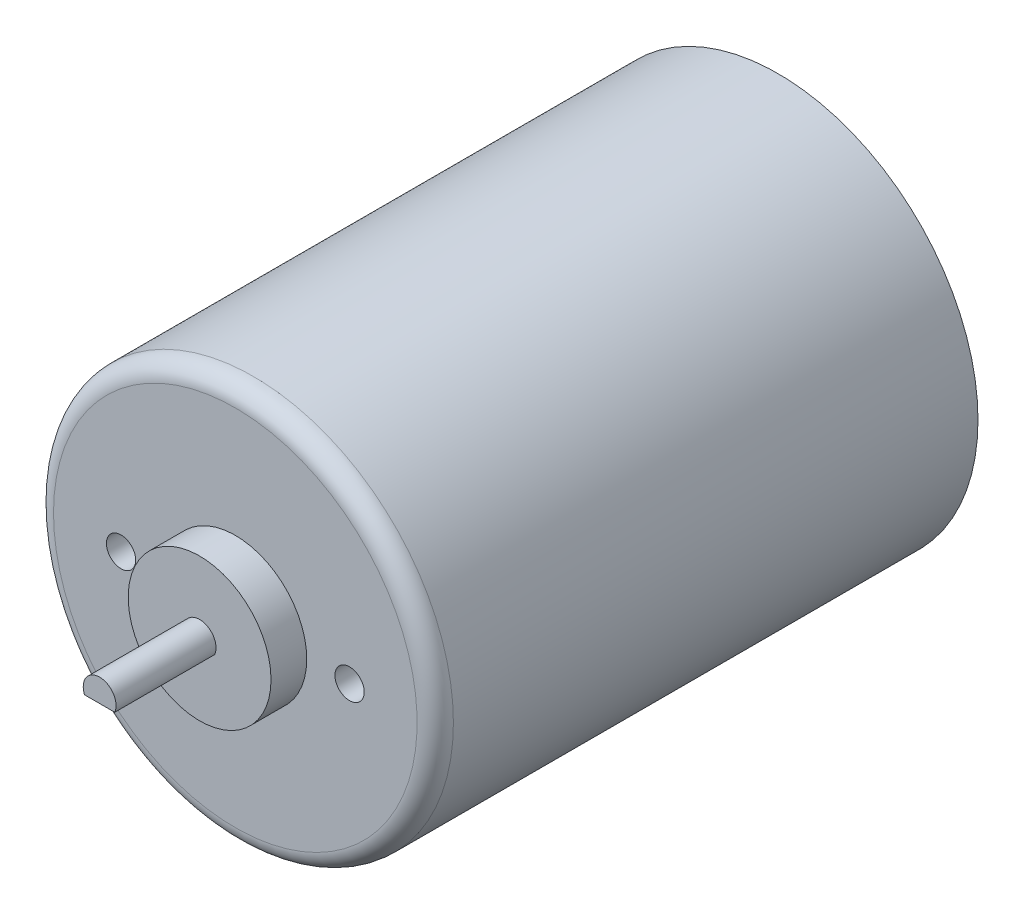
ISO-10303-21;
HEADER;
FILE_DESCRIPTION(('STEP AP214'),'2;1');
FILE_NAME('part.step','',(''),(''),'','','');
FILE_SCHEMA(('AUTOMOTIVE_DESIGN { 1 0 10303 214 1 1 1 1 }'));
ENDSEC;
DATA;
#1=APPLICATION_CONTEXT('core data for automotive mechanical design processes');
#2=APPLICATION_PROTOCOL_DEFINITION('international standard','automotive_design',2000,#1);
#3=PRODUCT_CONTEXT('',#1,'mechanical');
#4=PRODUCT('Part','Part','',(#3));
#5=PRODUCT_RELATED_PRODUCT_CATEGORY('part','',(#4));
#6=PRODUCT_DEFINITION_FORMATION('','',#4);
#7=PRODUCT_DEFINITION_CONTEXT('part definition',#1,'design');
#8=PRODUCT_DEFINITION('design','',#6,#7);
#9=PRODUCT_DEFINITION_SHAPE('','',#8);
#10=(LENGTH_UNIT() NAMED_UNIT(*) SI_UNIT(.MILLI.,.METRE.));
#11=(NAMED_UNIT(*) PLANE_ANGLE_UNIT() SI_UNIT($,.RADIAN.));
#12=(NAMED_UNIT(*) SI_UNIT($,.STERADIAN.) SOLID_ANGLE_UNIT());
#13=UNCERTAINTY_MEASURE_WITH_UNIT(LENGTH_MEASURE(1.E-05),#10,'distance_accuracy_value','');
#14=(GEOMETRIC_REPRESENTATION_CONTEXT(3) GLOBAL_UNCERTAINTY_ASSIGNED_CONTEXT((#13)) GLOBAL_UNIT_ASSIGNED_CONTEXT((#10,
#11,#12)) REPRESENTATION_CONTEXT('',''));
#15=CARTESIAN_POINT('',(0.,0.,0.));
#16=DIRECTION('',(0.,0.,1.));
#17=DIRECTION('',(1.,0.,0.));
#18=AXIS2_PLACEMENT_3D('',#15,#16,#17);
#19=CARTESIAN_POINT('',(0.,0.,2.5));
#20=DIRECTION('',(0.,0.,-1.));
#21=DIRECTION('',(-1.,0.,0.));
#22=AXIS2_PLACEMENT_3D('',#19,#20,#21);
#23=PLANE('',#22);
#24=CARTESIAN_POINT('',(0.,0.,2.5));
#25=DIRECTION('',(0.,0.,1.));
#26=DIRECTION('',(1.,0.,0.));
#27=AXIS2_PLACEMENT_3D('',#24,#25,#26);
#28=CIRCLE('',#27,5.);
#29=CARTESIAN_POINT('',(5.,0.,2.5));
#30=VERTEX_POINT('',#29);
#31=EDGE_CURVE('E123',#30,#30,#28,.T.);
#32=ORIENTED_EDGE('',*,*,#31,.T.);
#33=EDGE_LOOP('',(#32));
#34=FACE_BOUND('',#33,.T.);
#35=CARTESIAN_POINT('',(0.,0.,2.5));
#36=DIRECTION('',(0.,0.,1.));
#37=DIRECTION('',(1.,0.,0.));
#38=AXIS2_PLACEMENT_3D('',#35,#36,#37);
#39=CIRCLE('',#38,1.15);
#40=CARTESIAN_POINT('',(1.05830052442584,-0.45,2.5));
#41=VERTEX_POINT('',#40);
#42=CARTESIAN_POINT('',(-1.05830052442584,-0.45,2.5));
#43=VERTEX_POINT('',#42);
#44=EDGE_CURVE('E79',#41,#43,#39,.T.);
#45=ORIENTED_EDGE('',*,*,#44,.F.);
#46=DIRECTION('',(1.,0.,0.));
#47=VECTOR('',#46,1.);
#48=CARTESIAN_POINT('',(-1.05830052442584,-0.45,2.5));
#49=LINE('',#48,#47);
#50=EDGE_CURVE('E64',#43,#41,#49,.T.);
#51=ORIENTED_EDGE('',*,*,#50,.F.);
#52=EDGE_LOOP('',(#45,#51));
#53=FACE_BOUND('',#52,.T.);
#54=ADVANCED_FACE('F50',(#34,#53),#23,.F.);
#55=CARTESIAN_POINT('',(0.,0.,0.));
#56=DIRECTION('',(0.,0.,1.));
#57=DIRECTION('',(1.,0.,0.));
#58=AXIS2_PLACEMENT_3D('',#55,#56,#57);
#59=CYLINDRICAL_SURFACE('',#58,5.);
#60=ORIENTED_EDGE('',*,*,#31,.F.);
#61=EDGE_LOOP('',(#60));
#62=FACE_BOUND('',#61,.T.);
#63=CARTESIAN_POINT('',(0.,0.,0.));
#64=DIRECTION('',(0.,0.,1.));
#65=DIRECTION('',(1.,0.,0.));
#66=AXIS2_PLACEMENT_3D('',#63,#64,#65);
#67=CIRCLE('',#66,5.);
#68=CARTESIAN_POINT('',(5.,0.,0.));
#69=VERTEX_POINT('',#68);
#70=EDGE_CURVE('E120',#69,#69,#67,.T.);
#71=ORIENTED_EDGE('',*,*,#70,.T.);
#72=EDGE_LOOP('',(#71));
#73=FACE_BOUND('',#72,.T.);
#74=ADVANCED_FACE('F139',(#62,#73),#59,.T.);
#75=CARTESIAN_POINT('',(0.,5.,0.));
#76=DIRECTION('',(0.,0.,-1.));
#77=DIRECTION('',(-1.,0.,0.));
#78=AXIS2_PLACEMENT_3D('',#75,#76,#77);
#79=PLANE('',#78);
#80=CARTESIAN_POINT('',(0.,0.,0.));
#81=DIRECTION('',(0.,0.,-1.));
#82=DIRECTION('',(-1.,0.,0.));
#83=AXIS2_PLACEMENT_3D('',#80,#81,#82);
#84=CIRCLE('',#83,12.73);
#85=CARTESIAN_POINT('',(-12.73,0.,0.));
#86=VERTEX_POINT('',#85);
#87=EDGE_CURVE('E58',#86,#86,#84,.F.);
#88=ORIENTED_EDGE('',*,*,#87,.T.);
#89=EDGE_LOOP('',(#88));
#90=FACE_BOUND('',#89,.T.);
#91=CARTESIAN_POINT('',(8.,0.,0.));
#92=DIRECTION('',(0.,0.,1.));
#93=DIRECTION('',(1.,0.,0.));
#94=AXIS2_PLACEMENT_3D('',#91,#92,#93);
#95=CIRCLE('',#94,1.02499999999999);
#96=CARTESIAN_POINT('',(9.02499999999999,0.,0.));
#97=VERTEX_POINT('',#96);
#98=EDGE_CURVE('E97',#97,#97,#95,.T.);
#99=ORIENTED_EDGE('',*,*,#98,.F.);
#100=EDGE_LOOP('',(#99));
#101=FACE_BOUND('',#100,.T.);
#102=CARTESIAN_POINT('',(-8.,0.,0.));
#103=DIRECTION('',(0.,0.,1.));
#104=DIRECTION('',(1.,0.,0.));
#105=AXIS2_PLACEMENT_3D('',#102,#103,#104);
#106=CIRCLE('',#105,1.02499999999999);
#107=CARTESIAN_POINT('',(-6.97500000000001,0.,0.));
#108=VERTEX_POINT('',#107);
#109=EDGE_CURVE('E96',#108,#108,#106,.T.);
#110=ORIENTED_EDGE('',*,*,#109,.F.);
#111=EDGE_LOOP('',(#110));
#112=FACE_BOUND('',#111,.T.);
#113=ORIENTED_EDGE('',*,*,#70,.F.);
#114=EDGE_LOOP('',(#113));
#115=FACE_BOUND('',#114,.T.);
#116=ADVANCED_FACE('F128',(#90,#101,#112,#115),#79,.F.);
#117=CARTESIAN_POINT('',(0.,0.,0.));
#118=DIRECTION('',(0.,0.,1.));
#119=DIRECTION('',(1.,0.,0.));
#120=AXIS2_PLACEMENT_3D('',#117,#118,#119);
#121=CYLINDRICAL_SURFACE('',#120,14.);
#122=CARTESIAN_POINT('',(0.,0.,-1.27));
#123=DIRECTION('',(0.,0.,-1.));
#124=DIRECTION('',(-1.,0.,0.));
#125=AXIS2_PLACEMENT_3D('',#122,#123,#124);
#126=CIRCLE('',#125,14.);
#127=CARTESIAN_POINT('',(-14.,0.,-1.27));
#128=VERTEX_POINT('',#127);
#129=EDGE_CURVE('E13',#128,#128,#126,.T.);
#130=ORIENTED_EDGE('',*,*,#129,.T.);
#131=EDGE_LOOP('',(#130));
#132=FACE_BOUND('',#131,.T.);
#133=CARTESIAN_POINT('',(0.,0.,-38.));
#134=DIRECTION('',(0.,0.,1.));
#135=DIRECTION('',(1.,0.,0.));
#136=AXIS2_PLACEMENT_3D('',#133,#134,#135);
#137=CIRCLE('',#136,14.);
#138=CARTESIAN_POINT('',(14.,0.,-38.));
#139=VERTEX_POINT('',#138);
#140=EDGE_CURVE('E117',#139,#139,#137,.T.);
#141=ORIENTED_EDGE('',*,*,#140,.T.);
#142=EDGE_LOOP('',(#141));
#143=FACE_BOUND('',#142,.T.);
#144=ADVANCED_FACE('F149',(#132,#143),#121,.T.);
#145=CARTESIAN_POINT('',(0.,14.,-38.));
#146=DIRECTION('',(0.,0.,1.));
#147=DIRECTION('',(1.,0.,0.));
#148=AXIS2_PLACEMENT_3D('',#145,#146,#147);
#149=PLANE('',#148);
#150=ORIENTED_EDGE('',*,*,#140,.F.);
#151=EDGE_LOOP('',(#150));
#152=FACE_BOUND('',#151,.T.);
#153=ADVANCED_FACE('F152',(#152),#149,.F.);
#154=CARTESIAN_POINT('',(0.,0.,9.5));
#155=DIRECTION('',(0.,0.,-1.));
#156=DIRECTION('',(-1.,0.,0.));
#157=AXIS2_PLACEMENT_3D('',#154,#155,#156);
#158=CYLINDRICAL_SURFACE('',#157,1.15);
#159=ORIENTED_EDGE('',*,*,#44,.T.);
#160=DIRECTION('',(0.,0.,-1.));
#161=VECTOR('',#160,1.);
#162=CARTESIAN_POINT('',(-1.05830052442584,-0.45,9.5));
#163=LINE('',#162,#161);
#164=CARTESIAN_POINT('',(-1.05830052442584,-0.45,9.5));
#165=VERTEX_POINT('',#164);
#166=EDGE_CURVE('E115',#165,#43,#163,.T.);
#167=ORIENTED_EDGE('',*,*,#166,.F.);
#168=CARTESIAN_POINT('',(0.,0.,9.5));
#169=DIRECTION('',(0.,0.,1.));
#170=DIRECTION('',(1.,0.,0.));
#171=AXIS2_PLACEMENT_3D('',#168,#169,#170);
#172=CIRCLE('',#171,1.15);
#173=CARTESIAN_POINT('',(1.05830052442584,-0.45,9.5));
#174=VERTEX_POINT('',#173);
#175=EDGE_CURVE('E107',#174,#165,#172,.T.);
#176=ORIENTED_EDGE('',*,*,#175,.F.);
#177=DIRECTION('',(0.,0.,-1.));
#178=VECTOR('',#177,1.);
#179=CARTESIAN_POINT('',(1.05830052442584,-0.45,9.5));
#180=LINE('',#179,#178);
#181=EDGE_CURVE('E110',#174,#41,#180,.T.);
#182=ORIENTED_EDGE('',*,*,#181,.T.);
#183=EDGE_LOOP('',(#159,#167,#176,#182));
#184=FACE_BOUND('',#183,.T.);
#185=ADVANCED_FACE('F156',(#184),#158,.T.);
#186=CARTESIAN_POINT('',(-1.05830052442584,-0.45,9.5));
#187=DIRECTION('',(0.,1.,0.));
#188=DIRECTION('',(0.,0.,1.));
#189=AXIS2_PLACEMENT_3D('',#186,#187,#188);
#190=PLANE('',#189);
#191=ORIENTED_EDGE('',*,*,#50,.T.);
#192=ORIENTED_EDGE('',*,*,#181,.F.);
#193=DIRECTION('',(1.,0.,0.));
#194=VECTOR('',#193,1.);
#195=CARTESIAN_POINT('',(-1.05830052442584,-0.45,9.5));
#196=LINE('',#195,#194);
#197=EDGE_CURVE('E72',#165,#174,#196,.T.);
#198=ORIENTED_EDGE('',*,*,#197,.F.);
#199=ORIENTED_EDGE('',*,*,#166,.T.);
#200=EDGE_LOOP('',(#191,#192,#198,#199));
#201=FACE_BOUND('',#200,.T.);
#202=ADVANCED_FACE('F160',(#201),#190,.F.);
#203=CARTESIAN_POINT('',(0.,0.,9.5));
#204=DIRECTION('',(0.,0.,1.));
#205=DIRECTION('',(1.,0.,0.));
#206=AXIS2_PLACEMENT_3D('',#203,#204,#205);
#207=PLANE('',#206);
#208=ORIENTED_EDGE('',*,*,#175,.T.);
#209=ORIENTED_EDGE('',*,*,#197,.T.);
#210=EDGE_LOOP('',(#208,#209));
#211=FACE_BOUND('',#210,.T.);
#212=ADVANCED_FACE('F164',(#211),#207,.T.);
#213=CARTESIAN_POINT('',(-8.,0.,-6.42619999999999));
#214=DIRECTION('',(0.,0.,1.));
#215=DIRECTION('',(1.,0.,0.));
#216=AXIS2_PLACEMENT_3D('',#213,#214,#215);
#217=CONICAL_SURFACE('',#216,1.02499999999999,1.02974425867664);
#218=CARTESIAN_POINT('',(-8.,0.,-7.04208213450325));
#219=VERTEX_POINT('',#218);
#220=VERTEX_LOOP('',#219);
#221=FACE_BOUND('',#220,.T.);
#222=CARTESIAN_POINT('',(-8.,0.,-6.42619999999999));
#223=DIRECTION('',(0.,0.,1.));
#224=DIRECTION('',(1.,0.,0.));
#225=AXIS2_PLACEMENT_3D('',#222,#223,#224);
#226=CIRCLE('',#225,1.02499999999999);
#227=CARTESIAN_POINT('',(-6.97500000000001,0.,-6.42619999999999));
#228=VERTEX_POINT('',#227);
#229=EDGE_CURVE('E100',#228,#228,#226,.T.);
#230=ORIENTED_EDGE('',*,*,#229,.T.);
#231=EDGE_LOOP('',(#230));
#232=FACE_BOUND('',#231,.T.);
#233=ADVANCED_FACE('F168',(#221,#232),#217,.F.);
#234=CARTESIAN_POINT('',(-8.,0.,0.));
#235=DIRECTION('',(0.,0.,1.));
#236=DIRECTION('',(1.,0.,0.));
#237=AXIS2_PLACEMENT_3D('',#234,#235,#236);
#238=CYLINDRICAL_SURFACE('',#237,1.02499999999999);
#239=ORIENTED_EDGE('',*,*,#229,.F.);
#240=EDGE_LOOP('',(#239));
#241=FACE_BOUND('',#240,.T.);
#242=ORIENTED_EDGE('',*,*,#109,.T.);
#243=EDGE_LOOP('',(#242));
#244=FACE_BOUND('',#243,.T.);
#245=ADVANCED_FACE('F90',(#241,#244),#238,.F.);
#246=CARTESIAN_POINT('',(8.,0.,-6.42619999999999));
#247=DIRECTION('',(0.,0.,1.));
#248=DIRECTION('',(1.,0.,0.));
#249=AXIS2_PLACEMENT_3D('',#246,#247,#248);
#250=CONICAL_SURFACE('',#249,1.02499999999999,1.02974425867664);
#251=CARTESIAN_POINT('',(8.,0.,-7.04208213450325));
#252=VERTEX_POINT('',#251);
#253=VERTEX_LOOP('',#252);
#254=FACE_BOUND('',#253,.T.);
#255=CARTESIAN_POINT('',(8.,0.,-6.42619999999999));
#256=DIRECTION('',(0.,0.,1.));
#257=DIRECTION('',(1.,0.,0.));
#258=AXIS2_PLACEMENT_3D('',#255,#256,#257);
#259=CIRCLE('',#258,1.02499999999999);
#260=CARTESIAN_POINT('',(9.02499999999999,0.,-6.42619999999999));
#261=VERTEX_POINT('',#260);
#262=EDGE_CURVE('E94',#261,#261,#259,.T.);
#263=ORIENTED_EDGE('',*,*,#262,.T.);
#264=EDGE_LOOP('',(#263));
#265=FACE_BOUND('',#264,.T.);
#266=ADVANCED_FACE('F86',(#254,#265),#250,.F.);
#267=CARTESIAN_POINT('',(8.,0.,0.));
#268=DIRECTION('',(0.,0.,1.));
#269=DIRECTION('',(1.,0.,0.));
#270=AXIS2_PLACEMENT_3D('',#267,#268,#269);
#271=CYLINDRICAL_SURFACE('',#270,1.02499999999999);
#272=ORIENTED_EDGE('',*,*,#262,.F.);
#273=EDGE_LOOP('',(#272));
#274=FACE_BOUND('',#273,.T.);
#275=ORIENTED_EDGE('',*,*,#98,.T.);
#276=EDGE_LOOP('',(#275));
#277=FACE_BOUND('',#276,.T.);
#278=ADVANCED_FACE('F89',(#274,#277),#271,.F.);
#279=CARTESIAN_POINT('',(0.,0.,-1.27));
#280=DIRECTION('',(0.,0.,-1.));
#281=DIRECTION('',(-1.,0.,0.));
#282=AXIS2_PLACEMENT_3D('',#279,#280,#281);
#283=TOROIDAL_SURFACE('',#282,12.73,1.27);
#284=ORIENTED_EDGE('',*,*,#129,.F.);
#285=EDGE_LOOP('',(#284));
#286=FACE_BOUND('',#285,.T.);
#287=ORIENTED_EDGE('',*,*,#87,.F.);
#288=EDGE_LOOP('',(#287));
#289=FACE_BOUND('',#288,.T.);
#290=ADVANCED_FACE('F52',(#286,#289),#283,.T.);
#291=CLOSED_SHELL('',(#54,#74,#116,#144,#153,#185,#202,#212,#233,#245,#266,#278,#290));
#292=MANIFOLD_SOLID_BREP('B2',#291);
#293=ADVANCED_BREP_SHAPE_REPRESENTATION('',(#18,#292),#14);
#294=SHAPE_DEFINITION_REPRESENTATION(#9,#293);
ENDSEC;
END-ISO-10303-21;
